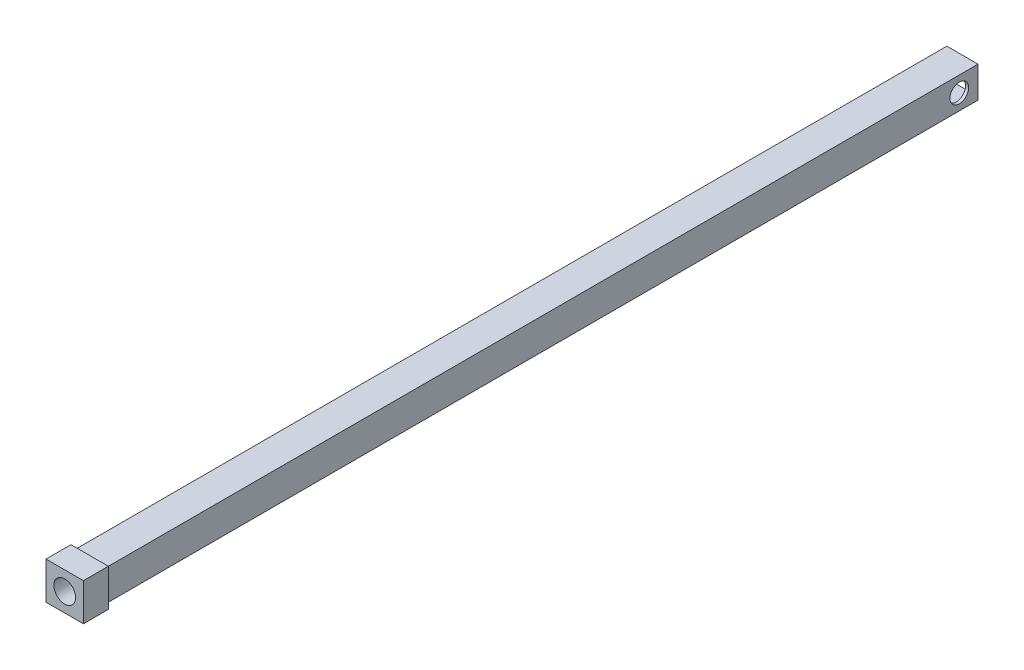
ISO-10303-21;
HEADER;
FILE_DESCRIPTION(('STEP AP214'),'2;1');
FILE_NAME('part.step','',(''),(''),'','','');
FILE_SCHEMA(('AUTOMOTIVE_DESIGN { 1 0 10303 214 1 1 1 1 }'));
ENDSEC;
DATA;
#1=APPLICATION_CONTEXT('core data for automotive mechanical design processes');
#2=APPLICATION_PROTOCOL_DEFINITION('international standard','automotive_design',2000,#1);
#3=PRODUCT_CONTEXT('',#1,'mechanical');
#4=PRODUCT('Part','Part','',(#3));
#5=PRODUCT_RELATED_PRODUCT_CATEGORY('part','',(#4));
#6=PRODUCT_DEFINITION_FORMATION('','',#4);
#7=PRODUCT_DEFINITION_CONTEXT('part definition',#1,'design');
#8=PRODUCT_DEFINITION('design','',#6,#7);
#9=PRODUCT_DEFINITION_SHAPE('','',#8);
#10=(LENGTH_UNIT() NAMED_UNIT(*) SI_UNIT(.MILLI.,.METRE.));
#11=(NAMED_UNIT(*) PLANE_ANGLE_UNIT() SI_UNIT($,.RADIAN.));
#12=(NAMED_UNIT(*) SI_UNIT($,.STERADIAN.) SOLID_ANGLE_UNIT());
#13=UNCERTAINTY_MEASURE_WITH_UNIT(LENGTH_MEASURE(1.E-05),#10,'distance_accuracy_value','');
#14=(GEOMETRIC_REPRESENTATION_CONTEXT(3) GLOBAL_UNCERTAINTY_ASSIGNED_CONTEXT((#13)) GLOBAL_UNIT_ASSIGNED_CONTEXT((#10,
#11,#12)) REPRESENTATION_CONTEXT('',''));
#15=CARTESIAN_POINT('',(0.,0.,0.));
#16=DIRECTION('',(0.,0.,1.));
#17=DIRECTION('',(1.,0.,0.));
#18=AXIS2_PLACEMENT_3D('',#15,#16,#17);
#19=CARTESIAN_POINT('',(0.,0.,0.));
#20=DIRECTION('',(0.,0.,-1.));
#21=DIRECTION('',(-1.,0.,0.));
#22=AXIS2_PLACEMENT_3D('',#19,#20,#21);
#23=PLANE('',#22);
#24=DIRECTION('',(0.,1.,0.));
#25=VECTOR('',#24,1.);
#26=CARTESIAN_POINT('',(5.,-5.,0.));
#27=LINE('',#26,#25);
#28=CARTESIAN_POINT('',(5.,-5.,0.));
#29=VERTEX_POINT('',#28);
#30=CARTESIAN_POINT('',(5.,5.,0.));
#31=VERTEX_POINT('',#30);
#32=EDGE_CURVE('E205',#29,#31,#27,.T.);
#33=ORIENTED_EDGE('',*,*,#32,.F.);
#34=DIRECTION('',(1.,0.,0.));
#35=VECTOR('',#34,1.);
#36=CARTESIAN_POINT('',(-5.,-5.,0.));
#37=LINE('',#36,#35);
#38=CARTESIAN_POINT('',(-5.,-5.,0.));
#39=VERTEX_POINT('',#38);
#40=EDGE_CURVE('E78',#39,#29,#37,.T.);
#41=ORIENTED_EDGE('',*,*,#40,.F.);
#42=DIRECTION('',(0.,-1.,0.));
#43=VECTOR('',#42,1.);
#44=CARTESIAN_POINT('',(-5.,-5.,0.));
#45=LINE('',#44,#43);
#46=CARTESIAN_POINT('',(-5.,5.,0.));
#47=VERTEX_POINT('',#46);
#48=EDGE_CURVE('E221',#47,#39,#45,.T.);
#49=ORIENTED_EDGE('',*,*,#48,.F.);
#50=DIRECTION('',(-1.,0.,0.));
#51=VECTOR('',#50,1.);
#52=CARTESIAN_POINT('',(-5.,5.,0.));
#53=LINE('',#52,#51);
#54=EDGE_CURVE('E219',#31,#47,#53,.T.);
#55=ORIENTED_EDGE('',*,*,#54,.F.);
#56=EDGE_LOOP('',(#33,#41,#49,#55));
#57=FACE_BOUND('',#56,.T.);
#58=DIRECTION('',(-1.,0.,0.));
#59=VECTOR('',#58,1.);
#60=CARTESIAN_POINT('',(4.,4.,0.));
#61=LINE('',#60,#59);
#62=CARTESIAN_POINT('',(4.,4.,0.));
#63=VERTEX_POINT('',#62);
#64=CARTESIAN_POINT('',(-4.,4.,0.));
#65=VERTEX_POINT('',#64);
#66=EDGE_CURVE('E179',#63,#65,#61,.T.);
#67=ORIENTED_EDGE('',*,*,#66,.T.);
#68=DIRECTION('',(0.,-1.,0.));
#69=VECTOR('',#68,1.);
#70=CARTESIAN_POINT('',(-4.,-4.,0.));
#71=LINE('',#70,#69);
#72=CARTESIAN_POINT('',(-4.,-4.,0.));
#73=VERTEX_POINT('',#72);
#74=EDGE_CURVE('E49',#65,#73,#71,.T.);
#75=ORIENTED_EDGE('',*,*,#74,.T.);
#76=DIRECTION('',(1.,0.,0.));
#77=VECTOR('',#76,1.);
#78=CARTESIAN_POINT('',(4.,-4.,0.));
#79=LINE('',#78,#77);
#80=CARTESIAN_POINT('',(4.,-4.,0.));
#81=VERTEX_POINT('',#80);
#82=EDGE_CURVE('E190',#73,#81,#79,.T.);
#83=ORIENTED_EDGE('',*,*,#82,.T.);
#84=DIRECTION('',(0.,1.,0.));
#85=VECTOR('',#84,1.);
#86=CARTESIAN_POINT('',(4.,-4.,0.));
#87=LINE('',#86,#85);
#88=EDGE_CURVE('E193',#81,#63,#87,.T.);
#89=ORIENTED_EDGE('',*,*,#88,.T.);
#90=EDGE_LOOP('',(#67,#75,#83,#89));
#91=FACE_BOUND('',#90,.T.);
#92=ADVANCED_FACE('F33',(#57,#91),#23,.T.);
#93=CARTESIAN_POINT('',(5.,-5.,280.));
#94=DIRECTION('',(-1.,0.,0.));
#95=DIRECTION('',(0.,0.,1.));
#96=AXIS2_PLACEMENT_3D('',#93,#94,#95);
#97=PLANE('',#96);
#98=CARTESIAN_POINT('',(5.,0.,6.));
#99=DIRECTION('',(1.,0.,0.));
#100=DIRECTION('',(0.,0.,-1.));
#101=AXIS2_PLACEMENT_3D('',#98,#99,#100);
#102=CIRCLE('',#101,3.);
#103=CARTESIAN_POINT('',(5.,0.,3.));
#104=VERTEX_POINT('',#103);
#105=EDGE_CURVE('E161',#104,#104,#102,.T.);
#106=ORIENTED_EDGE('',*,*,#105,.F.);
#107=EDGE_LOOP('',(#106));
#108=FACE_BOUND('',#107,.T.);
#109=ORIENTED_EDGE('',*,*,#32,.T.);
#110=DIRECTION('',(0.,0.,-1.));
#111=VECTOR('',#110,1.);
#112=CARTESIAN_POINT('',(5.,5.,280.));
#113=LINE('',#112,#111);
#114=CARTESIAN_POINT('',(5.,5.,280.));
#115=VERTEX_POINT('',#114);
#116=EDGE_CURVE('E11',#115,#31,#113,.T.);
#117=ORIENTED_EDGE('',*,*,#116,.F.);
#118=DIRECTION('',(0.,1.,0.));
#119=VECTOR('',#118,1.);
#120=CARTESIAN_POINT('',(5.,-5.,280.));
#121=LINE('',#120,#119);
#122=CARTESIAN_POINT('',(5.,-5.,280.));
#123=VERTEX_POINT('',#122);
#124=EDGE_CURVE('E206',#123,#115,#121,.T.);
#125=ORIENTED_EDGE('',*,*,#124,.F.);
#126=DIRECTION('',(0.,0.,-1.));
#127=VECTOR('',#126,1.);
#128=CARTESIAN_POINT('',(5.,-5.,280.));
#129=LINE('',#128,#127);
#130=EDGE_CURVE('E216',#123,#29,#129,.T.);
#131=ORIENTED_EDGE('',*,*,#130,.T.);
#132=EDGE_LOOP('',(#109,#117,#125,#131));
#133=FACE_BOUND('',#132,.T.);
#134=ADVANCED_FACE('F35',(#108,#133),#97,.F.);
#135=CARTESIAN_POINT('',(-5.,5.,280.));
#136=DIRECTION('',(0.,-1.,0.));
#137=DIRECTION('',(0.,0.,-1.));
#138=AXIS2_PLACEMENT_3D('',#135,#136,#137);
#139=PLANE('',#138);
#140=ORIENTED_EDGE('',*,*,#54,.T.);
#141=DIRECTION('',(0.,0.,-1.));
#142=VECTOR('',#141,1.);
#143=CARTESIAN_POINT('',(-5.,5.,280.));
#144=LINE('',#143,#142);
#145=CARTESIAN_POINT('',(-5.,5.,280.));
#146=VERTEX_POINT('',#145);
#147=EDGE_CURVE('E42',#146,#47,#144,.T.);
#148=ORIENTED_EDGE('',*,*,#147,.F.);
#149=DIRECTION('',(-1.,0.,0.));
#150=VECTOR('',#149,1.);
#151=CARTESIAN_POINT('',(-5.,5.,280.));
#152=LINE('',#151,#150);
#153=EDGE_CURVE('E83',#115,#146,#152,.T.);
#154=ORIENTED_EDGE('',*,*,#153,.F.);
#155=ORIENTED_EDGE('',*,*,#116,.T.);
#156=EDGE_LOOP('',(#140,#148,#154,#155));
#157=FACE_BOUND('',#156,.T.);
#158=ADVANCED_FACE('F257',(#157),#139,.F.);
#159=CARTESIAN_POINT('',(-5.,-5.,280.));
#160=DIRECTION('',(1.,0.,0.));
#161=DIRECTION('',(0.,0.,-1.));
#162=AXIS2_PLACEMENT_3D('',#159,#160,#161);
#163=PLANE('',#162);
#164=CARTESIAN_POINT('',(-5.,0.,6.));
#165=DIRECTION('',(1.,0.,0.));
#166=DIRECTION('',(0.,0.,-1.));
#167=AXIS2_PLACEMENT_3D('',#164,#165,#166);
#168=CIRCLE('',#167,3.);
#169=CARTESIAN_POINT('',(-5.,0.,3.));
#170=VERTEX_POINT('',#169);
#171=EDGE_CURVE('E172',#170,#170,#168,.T.);
#172=ORIENTED_EDGE('',*,*,#171,.T.);
#173=EDGE_LOOP('',(#172));
#174=FACE_BOUND('',#173,.T.);
#175=ORIENTED_EDGE('',*,*,#48,.T.);
#176=DIRECTION('',(0.,0.,-1.));
#177=VECTOR('',#176,1.);
#178=CARTESIAN_POINT('',(-5.,-5.,280.));
#179=LINE('',#178,#177);
#180=CARTESIAN_POINT('',(-5.,-5.,280.));
#181=VERTEX_POINT('',#180);
#182=EDGE_CURVE('E58',#181,#39,#179,.T.);
#183=ORIENTED_EDGE('',*,*,#182,.F.);
#184=DIRECTION('',(0.,-1.,0.));
#185=VECTOR('',#184,1.);
#186=CARTESIAN_POINT('',(-5.,-5.,280.));
#187=LINE('',#186,#185);
#188=EDGE_CURVE('E210',#146,#181,#187,.T.);
#189=ORIENTED_EDGE('',*,*,#188,.F.);
#190=ORIENTED_EDGE('',*,*,#147,.T.);
#191=EDGE_LOOP('',(#175,#183,#189,#190));
#192=FACE_BOUND('',#191,.T.);
#193=ADVANCED_FACE('F228',(#174,#192),#163,.F.);
#194=CARTESIAN_POINT('',(-5.,-5.,280.));
#195=DIRECTION('',(0.,1.,0.));
#196=DIRECTION('',(0.,0.,1.));
#197=AXIS2_PLACEMENT_3D('',#194,#195,#196);
#198=PLANE('',#197);
#199=ORIENTED_EDGE('',*,*,#40,.T.);
#200=ORIENTED_EDGE('',*,*,#130,.F.);
#201=DIRECTION('',(1.,0.,0.));
#202=VECTOR('',#201,1.);
#203=CARTESIAN_POINT('',(-5.,-5.,280.));
#204=LINE('',#203,#202);
#205=EDGE_CURVE('E213',#181,#123,#204,.T.);
#206=ORIENTED_EDGE('',*,*,#205,.F.);
#207=ORIENTED_EDGE('',*,*,#182,.T.);
#208=EDGE_LOOP('',(#199,#200,#206,#207));
#209=FACE_BOUND('',#208,.T.);
#210=ADVANCED_FACE('F233',(#209),#198,.F.);
#211=CARTESIAN_POINT('',(-4.,-4.,280.));
#212=DIRECTION('',(1.,0.,0.));
#213=DIRECTION('',(0.,0.,-1.));
#214=AXIS2_PLACEMENT_3D('',#211,#212,#213);
#215=PLANE('',#214);
#216=CARTESIAN_POINT('',(-4.,0.,6.));
#217=DIRECTION('',(1.,0.,0.));
#218=DIRECTION('',(0.,0.,-1.));
#219=AXIS2_PLACEMENT_3D('',#216,#217,#218);
#220=CIRCLE('',#219,3.);
#221=CARTESIAN_POINT('',(-4.,0.,3.));
#222=VERTEX_POINT('',#221);
#223=EDGE_CURVE('E169',#222,#222,#220,.T.);
#224=ORIENTED_EDGE('',*,*,#223,.F.);
#225=EDGE_LOOP('',(#224));
#226=FACE_BOUND('',#225,.T.);
#227=ORIENTED_EDGE('',*,*,#74,.F.);
#228=DIRECTION('',(0.,0.,-1.));
#229=VECTOR('',#228,1.);
#230=CARTESIAN_POINT('',(-4.,4.,280.));
#231=LINE('',#230,#229);
#232=CARTESIAN_POINT('',(-4.,4.,280.));
#233=VERTEX_POINT('',#232);
#234=EDGE_CURVE('E188',#233,#65,#231,.T.);
#235=ORIENTED_EDGE('',*,*,#234,.F.);
#236=DIRECTION('',(0.,-1.,0.));
#237=VECTOR('',#236,1.);
#238=CARTESIAN_POINT('',(-4.,-4.,280.));
#239=LINE('',#238,#237);
#240=CARTESIAN_POINT('',(-4.,-4.,280.));
#241=VERTEX_POINT('',#240);
#242=EDGE_CURVE('E175',#233,#241,#239,.T.);
#243=ORIENTED_EDGE('',*,*,#242,.T.);
#244=DIRECTION('',(0.,0.,-1.));
#245=VECTOR('',#244,1.);
#246=CARTESIAN_POINT('',(-4.,-4.,280.));
#247=LINE('',#246,#245);
#248=EDGE_CURVE('E203',#241,#73,#247,.T.);
#249=ORIENTED_EDGE('',*,*,#248,.T.);
#250=EDGE_LOOP('',(#227,#235,#243,#249));
#251=FACE_BOUND('',#250,.T.);
#252=ADVANCED_FACE('F261',(#226,#251),#215,.T.);
#253=CARTESIAN_POINT('',(4.,-4.,280.));
#254=DIRECTION('',(0.,1.,0.));
#255=DIRECTION('',(-1.,0.,0.));
#256=AXIS2_PLACEMENT_3D('',#253,#254,#255);
#257=PLANE('',#256);
#258=ORIENTED_EDGE('',*,*,#82,.F.);
#259=ORIENTED_EDGE('',*,*,#248,.F.);
#260=DIRECTION('',(1.,0.,0.));
#261=VECTOR('',#260,1.);
#262=CARTESIAN_POINT('',(4.,-4.,280.));
#263=LINE('',#262,#261);
#264=CARTESIAN_POINT('',(4.,-4.,280.));
#265=VERTEX_POINT('',#264);
#266=EDGE_CURVE('E178',#241,#265,#263,.T.);
#267=ORIENTED_EDGE('',*,*,#266,.T.);
#268=DIRECTION('',(0.,0.,-1.));
#269=VECTOR('',#268,1.);
#270=CARTESIAN_POINT('',(4.,-4.,280.));
#271=LINE('',#270,#269);
#272=EDGE_CURVE('E201',#265,#81,#271,.T.);
#273=ORIENTED_EDGE('',*,*,#272,.T.);
#274=EDGE_LOOP('',(#258,#259,#267,#273));
#275=FACE_BOUND('',#274,.T.);
#276=ADVANCED_FACE('F286',(#275),#257,.T.);
#277=CARTESIAN_POINT('',(4.,-4.,280.));
#278=DIRECTION('',(-1.,0.,0.));
#279=DIRECTION('',(0.,0.,1.));
#280=AXIS2_PLACEMENT_3D('',#277,#278,#279);
#281=PLANE('',#280);
#282=CARTESIAN_POINT('',(4.,0.,6.));
#283=DIRECTION('',(-1.,0.,0.));
#284=DIRECTION('',(0.,0.,1.));
#285=AXIS2_PLACEMENT_3D('',#282,#283,#284);
#286=CIRCLE('',#285,3.);
#287=CARTESIAN_POINT('',(4.,0.,9.));
#288=VERTEX_POINT('',#287);
#289=EDGE_CURVE('E37',#288,#288,#286,.T.);
#290=ORIENTED_EDGE('',*,*,#289,.F.);
#291=EDGE_LOOP('',(#290));
#292=FACE_BOUND('',#291,.T.);
#293=ORIENTED_EDGE('',*,*,#88,.F.);
#294=ORIENTED_EDGE('',*,*,#272,.F.);
#295=DIRECTION('',(0.,1.,0.));
#296=VECTOR('',#295,1.);
#297=CARTESIAN_POINT('',(4.,-4.,280.));
#298=LINE('',#297,#296);
#299=CARTESIAN_POINT('',(4.,4.,280.));
#300=VERTEX_POINT('',#299);
#301=EDGE_CURVE('E182',#265,#300,#298,.T.);
#302=ORIENTED_EDGE('',*,*,#301,.T.);
#303=DIRECTION('',(0.,0.,-1.));
#304=VECTOR('',#303,1.);
#305=CARTESIAN_POINT('',(4.,4.,280.));
#306=LINE('',#305,#304);
#307=EDGE_CURVE('E199',#300,#63,#306,.T.);
#308=ORIENTED_EDGE('',*,*,#307,.T.);
#309=EDGE_LOOP('',(#293,#294,#302,#308));
#310=FACE_BOUND('',#309,.T.);
#311=ADVANCED_FACE('F293',(#292,#310),#281,.T.);
#312=CARTESIAN_POINT('',(4.,4.,280.));
#313=DIRECTION('',(0.,-1.,0.));
#314=DIRECTION('',(1.,0.,0.));
#315=AXIS2_PLACEMENT_3D('',#312,#313,#314);
#316=PLANE('',#315);
#317=ORIENTED_EDGE('',*,*,#66,.F.);
#318=ORIENTED_EDGE('',*,*,#307,.F.);
#319=DIRECTION('',(-1.,0.,0.));
#320=VECTOR('',#319,1.);
#321=CARTESIAN_POINT('',(4.,4.,280.));
#322=LINE('',#321,#320);
#323=EDGE_CURVE('E185',#300,#233,#322,.T.);
#324=ORIENTED_EDGE('',*,*,#323,.T.);
#325=ORIENTED_EDGE('',*,*,#234,.T.);
#326=EDGE_LOOP('',(#317,#318,#324,#325));
#327=FACE_BOUND('',#326,.T.);
#328=ADVANCED_FACE('F300',(#327),#316,.T.);
#329=CARTESIAN_POINT('',(-47.,0.,6.));
#330=DIRECTION('',(1.,0.,0.));
#331=DIRECTION('',(0.,0.,-1.));
#332=AXIS2_PLACEMENT_3D('',#329,#330,#331);
#333=CYLINDRICAL_SURFACE('',#332,3.);
#334=ORIENTED_EDGE('',*,*,#289,.T.);
#335=EDGE_LOOP('',(#334));
#336=FACE_BOUND('',#335,.T.);
#337=ORIENTED_EDGE('',*,*,#105,.T.);
#338=EDGE_LOOP('',(#337));
#339=FACE_BOUND('',#338,.T.);
#340=ADVANCED_FACE('F246',(#336,#339),#333,.F.);
#341=ORIENTED_EDGE('',*,*,#223,.T.);
#342=EDGE_LOOP('',(#341));
#343=FACE_BOUND('',#342,.T.);
#344=ORIENTED_EDGE('',*,*,#171,.F.);
#345=EDGE_LOOP('',(#344));
#346=FACE_BOUND('',#345,.T.);
#347=ADVANCED_FACE('F237',(#343,#346),#333,.F.);
#348=CARTESIAN_POINT('',(0.,0.,280.));
#349=DIRECTION('',(0.,0.,-1.));
#350=DIRECTION('',(-1.,0.,0.));
#351=AXIS2_PLACEMENT_3D('',#348,#349,#350);
#352=PLANE('',#351);
#353=DIRECTION('',(0.,1.,0.));
#354=VECTOR('',#353,1.);
#355=CARTESIAN_POINT('',(6.,-6.,280.));
#356=LINE('',#355,#354);
#357=CARTESIAN_POINT('',(6.,-6.,280.));
#358=VERTEX_POINT('',#357);
#359=CARTESIAN_POINT('',(6.,6.,280.));
#360=VERTEX_POINT('',#359);
#361=EDGE_CURVE('E160',#358,#360,#356,.T.);
#362=ORIENTED_EDGE('',*,*,#361,.F.);
#363=DIRECTION('',(1.,0.,0.));
#364=VECTOR('',#363,1.);
#365=CARTESIAN_POINT('',(-6.,-6.,280.));
#366=LINE('',#365,#364);
#367=CARTESIAN_POINT('',(-6.,-6.,280.));
#368=VERTEX_POINT('',#367);
#369=EDGE_CURVE('E156',#368,#358,#366,.T.);
#370=ORIENTED_EDGE('',*,*,#369,.F.);
#371=DIRECTION('',(0.,-1.,0.));
#372=VECTOR('',#371,1.);
#373=CARTESIAN_POINT('',(-6.,-6.,280.));
#374=LINE('',#373,#372);
#375=CARTESIAN_POINT('',(-6.,6.,280.));
#376=VERTEX_POINT('',#375);
#377=EDGE_CURVE('E425',#376,#368,#374,.T.);
#378=ORIENTED_EDGE('',*,*,#377,.F.);
#379=DIRECTION('',(-1.,0.,0.));
#380=VECTOR('',#379,1.);
#381=CARTESIAN_POINT('',(-6.,6.,280.));
#382=LINE('',#381,#380);
#383=EDGE_CURVE('E423',#360,#376,#382,.T.);
#384=ORIENTED_EDGE('',*,*,#383,.F.);
#385=EDGE_LOOP('',(#362,#370,#378,#384));
#386=FACE_BOUND('',#385,.T.);
#387=ORIENTED_EDGE('',*,*,#124,.T.);
#388=ORIENTED_EDGE('',*,*,#153,.T.);
#389=ORIENTED_EDGE('',*,*,#188,.T.);
#390=ORIENTED_EDGE('',*,*,#205,.T.);
#391=EDGE_LOOP('',(#387,#388,#389,#390));
#392=FACE_BOUND('',#391,.T.);
#393=ADVANCED_FACE('F235',(#386,#392),#352,.T.);
#394=CARTESIAN_POINT('',(0.,0.,288.));
#395=DIRECTION('',(0.,0.,-1.));
#396=DIRECTION('',(-1.,0.,0.));
#397=AXIS2_PLACEMENT_3D('',#394,#395,#396);
#398=PLANE('',#397);
#399=DIRECTION('',(0.,1.,0.));
#400=VECTOR('',#399,1.);
#401=CARTESIAN_POINT('',(6.,-6.,288.));
#402=LINE('',#401,#400);
#403=CARTESIAN_POINT('',(6.,-6.,288.));
#404=VERTEX_POINT('',#403);
#405=CARTESIAN_POINT('',(6.,6.,288.));
#406=VERTEX_POINT('',#405);
#407=EDGE_CURVE('E146',#404,#406,#402,.T.);
#408=ORIENTED_EDGE('',*,*,#407,.T.);
#409=DIRECTION('',(-1.,0.,0.));
#410=VECTOR('',#409,1.);
#411=CARTESIAN_POINT('',(-6.,6.,288.));
#412=LINE('',#411,#410);
#413=CARTESIAN_POINT('',(-6.,6.,288.));
#414=VERTEX_POINT('',#413);
#415=EDGE_CURVE('E135',#406,#414,#412,.T.);
#416=ORIENTED_EDGE('',*,*,#415,.T.);
#417=DIRECTION('',(0.,-1.,0.));
#418=VECTOR('',#417,1.);
#419=CARTESIAN_POINT('',(-6.,-6.,288.));
#420=LINE('',#419,#418);
#421=CARTESIAN_POINT('',(-6.,-6.,288.));
#422=VERTEX_POINT('',#421);
#423=EDGE_CURVE('E145',#414,#422,#420,.T.);
#424=ORIENTED_EDGE('',*,*,#423,.T.);
#425=DIRECTION('',(1.,0.,0.));
#426=VECTOR('',#425,1.);
#427=CARTESIAN_POINT('',(-6.,-6.,288.));
#428=LINE('',#427,#426);
#429=EDGE_CURVE('E152',#422,#404,#428,.T.);
#430=ORIENTED_EDGE('',*,*,#429,.T.);
#431=EDGE_LOOP('',(#408,#416,#424,#430));
#432=FACE_BOUND('',#431,.T.);
#433=CARTESIAN_POINT('',(0.,0.,288.));
#434=DIRECTION('',(0.,0.,1.));
#435=DIRECTION('',(1.,0.,0.));
#436=AXIS2_PLACEMENT_3D('',#433,#434,#435);
#437=CIRCLE('',#436,3.5);
#438=CARTESIAN_POINT('',(3.5,0.,288.));
#439=VERTEX_POINT('',#438);
#440=EDGE_CURVE('E411',#439,#439,#437,.T.);
#441=ORIENTED_EDGE('',*,*,#440,.F.);
#442=EDGE_LOOP('',(#441));
#443=FACE_BOUND('',#442,.T.);
#444=ADVANCED_FACE('F149',(#432,#443),#398,.F.);
#445=ORIENTED_EDGE('',*,*,#266,.F.);
#446=ORIENTED_EDGE('',*,*,#242,.F.);
#447=ORIENTED_EDGE('',*,*,#323,.F.);
#448=ORIENTED_EDGE('',*,*,#301,.F.);
#449=EDGE_LOOP('',(#445,#446,#447,#448));
#450=FACE_BOUND('',#449,.T.);
#451=CARTESIAN_POINT('',(0.,0.,280.));
#452=DIRECTION('',(0.,0.,1.));
#453=DIRECTION('',(1.,0.,0.));
#454=AXIS2_PLACEMENT_3D('',#451,#452,#453);
#455=CIRCLE('',#454,3.5);
#456=CARTESIAN_POINT('',(3.5,0.,280.));
#457=VERTEX_POINT('',#456);
#458=EDGE_CURVE('E414',#457,#457,#455,.T.);
#459=ORIENTED_EDGE('',*,*,#458,.T.);
#460=EDGE_LOOP('',(#459));
#461=FACE_BOUND('',#460,.T.);
#462=ADVANCED_FACE('F240',(#450,#461),#352,.T.);
#463=CARTESIAN_POINT('',(6.,-6.,288.));
#464=DIRECTION('',(-1.,0.,0.));
#465=DIRECTION('',(0.,0.,1.));
#466=AXIS2_PLACEMENT_3D('',#463,#464,#465);
#467=PLANE('',#466);
#468=ORIENTED_EDGE('',*,*,#361,.T.);
#469=DIRECTION('',(0.,0.,-1.));
#470=VECTOR('',#469,1.);
#471=CARTESIAN_POINT('',(6.,6.,288.));
#472=LINE('',#471,#470);
#473=EDGE_CURVE('E139',#406,#360,#472,.T.);
#474=ORIENTED_EDGE('',*,*,#473,.F.);
#475=ORIENTED_EDGE('',*,*,#407,.F.);
#476=DIRECTION('',(0.,0.,-1.));
#477=VECTOR('',#476,1.);
#478=CARTESIAN_POINT('',(6.,-6.,288.));
#479=LINE('',#478,#477);
#480=EDGE_CURVE('E421',#404,#358,#479,.T.);
#481=ORIENTED_EDGE('',*,*,#480,.T.);
#482=EDGE_LOOP('',(#468,#474,#475,#481));
#483=FACE_BOUND('',#482,.T.);
#484=ADVANCED_FACE('F158',(#483),#467,.F.);
#485=CARTESIAN_POINT('',(-6.,6.,288.));
#486=DIRECTION('',(0.,-1.,0.));
#487=DIRECTION('',(0.,0.,-1.));
#488=AXIS2_PLACEMENT_3D('',#485,#486,#487);
#489=PLANE('',#488);
#490=ORIENTED_EDGE('',*,*,#383,.T.);
#491=DIRECTION('',(0.,0.,-1.));
#492=VECTOR('',#491,1.);
#493=CARTESIAN_POINT('',(-6.,6.,288.));
#494=LINE('',#493,#492);
#495=EDGE_CURVE('E142',#414,#376,#494,.T.);
#496=ORIENTED_EDGE('',*,*,#495,.F.);
#497=ORIENTED_EDGE('',*,*,#415,.F.);
#498=ORIENTED_EDGE('',*,*,#473,.T.);
#499=EDGE_LOOP('',(#490,#496,#497,#498));
#500=FACE_BOUND('',#499,.T.);
#501=ADVANCED_FACE('F137',(#500),#489,.F.);
#502=CARTESIAN_POINT('',(-6.,-6.,288.));
#503=DIRECTION('',(1.,0.,0.));
#504=DIRECTION('',(0.,0.,-1.));
#505=AXIS2_PLACEMENT_3D('',#502,#503,#504);
#506=PLANE('',#505);
#507=ORIENTED_EDGE('',*,*,#377,.T.);
#508=DIRECTION('',(0.,0.,-1.));
#509=VECTOR('',#508,1.);
#510=CARTESIAN_POINT('',(-6.,-6.,288.));
#511=LINE('',#510,#509);
#512=EDGE_CURVE('E165',#422,#368,#511,.T.);
#513=ORIENTED_EDGE('',*,*,#512,.F.);
#514=ORIENTED_EDGE('',*,*,#423,.F.);
#515=ORIENTED_EDGE('',*,*,#495,.T.);
#516=EDGE_LOOP('',(#507,#513,#514,#515));
#517=FACE_BOUND('',#516,.T.);
#518=ADVANCED_FACE('F374',(#517),#506,.F.);
#519=CARTESIAN_POINT('',(-6.,-6.,288.));
#520=DIRECTION('',(0.,1.,0.));
#521=DIRECTION('',(0.,0.,1.));
#522=AXIS2_PLACEMENT_3D('',#519,#520,#521);
#523=PLANE('',#522);
#524=ORIENTED_EDGE('',*,*,#369,.T.);
#525=ORIENTED_EDGE('',*,*,#480,.F.);
#526=ORIENTED_EDGE('',*,*,#429,.F.);
#527=ORIENTED_EDGE('',*,*,#512,.T.);
#528=EDGE_LOOP('',(#524,#525,#526,#527));
#529=FACE_BOUND('',#528,.T.);
#530=ADVANCED_FACE('F382',(#529),#523,.F.);
#531=CARTESIAN_POINT('',(0.,0.,288.));
#532=DIRECTION('',(0.,0.,-1.));
#533=DIRECTION('',(-1.,0.,0.));
#534=AXIS2_PLACEMENT_3D('',#531,#532,#533);
#535=CYLINDRICAL_SURFACE('',#534,3.5);
#536=ORIENTED_EDGE('',*,*,#440,.T.);
#537=EDGE_LOOP('',(#536));
#538=FACE_BOUND('',#537,.T.);
#539=ORIENTED_EDGE('',*,*,#458,.F.);
#540=EDGE_LOOP('',(#539));
#541=FACE_BOUND('',#540,.T.);
#542=ADVANCED_FACE('F391',(#538,#541),#535,.F.);
#543=CLOSED_SHELL('',(#92,#134,#158,#193,#210,#252,#276,#311,#328,#340,#347,#393,#444,#462,#484,
#501,#518,#530,#542));
#544=MANIFOLD_SOLID_BREP('B2',#543);
#545=ADVANCED_BREP_SHAPE_REPRESENTATION('',(#18,#544),#14);
#546=SHAPE_DEFINITION_REPRESENTATION(#9,#545);
ENDSEC;
END-ISO-10303-21;
